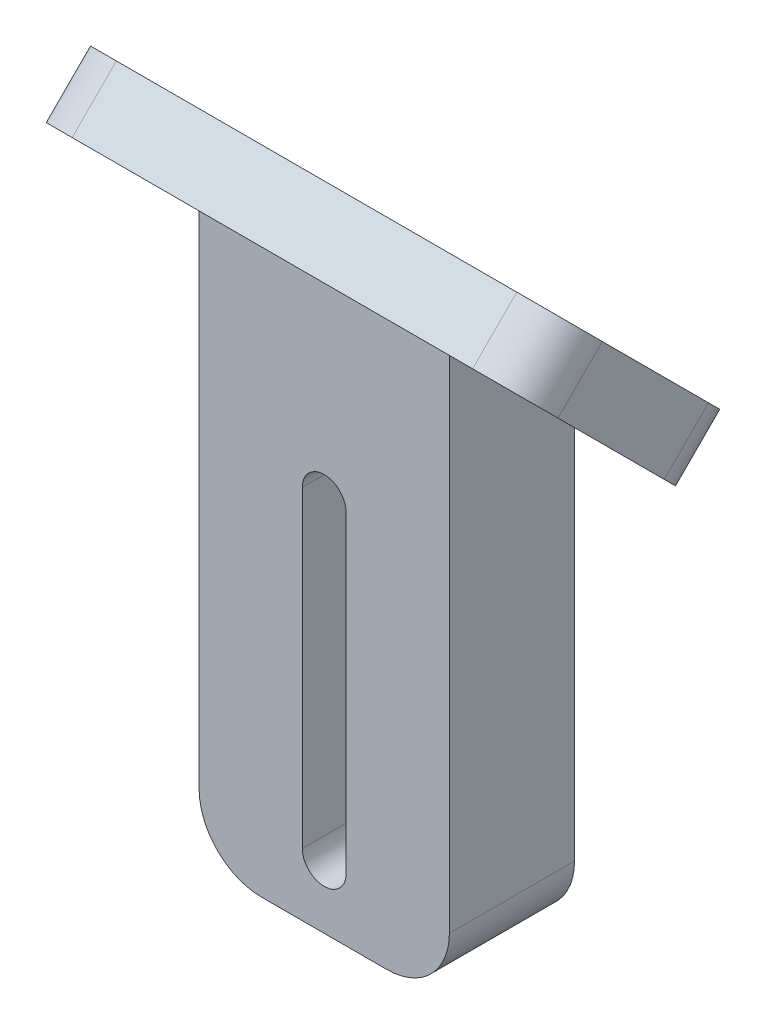
ISO-10303-21;
HEADER;
FILE_DESCRIPTION(('STEP AP214'),'2;1');
FILE_NAME('part.step','',(''),(''),'','','');
FILE_SCHEMA(('AUTOMOTIVE_DESIGN { 1 0 10303 214 1 1 1 1 }'));
ENDSEC;
DATA;
#1=APPLICATION_CONTEXT('core data for automotive mechanical design processes');
#2=APPLICATION_PROTOCOL_DEFINITION('international standard','automotive_design',2000,#1);
#3=PRODUCT_CONTEXT('',#1,'mechanical');
#4=PRODUCT('Part','Part','',(#3));
#5=PRODUCT_RELATED_PRODUCT_CATEGORY('part','',(#4));
#6=PRODUCT_DEFINITION_FORMATION('','',#4);
#7=PRODUCT_DEFINITION_CONTEXT('part definition',#1,'design');
#8=PRODUCT_DEFINITION('design','',#6,#7);
#9=PRODUCT_DEFINITION_SHAPE('','',#8);
#10=(LENGTH_UNIT() NAMED_UNIT(*) SI_UNIT(.MILLI.,.METRE.));
#11=(NAMED_UNIT(*) PLANE_ANGLE_UNIT() SI_UNIT($,.RADIAN.));
#12=(NAMED_UNIT(*) SI_UNIT($,.STERADIAN.) SOLID_ANGLE_UNIT());
#13=UNCERTAINTY_MEASURE_WITH_UNIT(LENGTH_MEASURE(1.E-05),#10,'distance_accuracy_value','');
#14=(GEOMETRIC_REPRESENTATION_CONTEXT(3) GLOBAL_UNCERTAINTY_ASSIGNED_CONTEXT((#13)) GLOBAL_UNIT_ASSIGNED_CONTEXT((#10,
#11,#12)) REPRESENTATION_CONTEXT('',''));
#15=CARTESIAN_POINT('',(0.,0.,0.));
#16=DIRECTION('',(0.,0.,1.));
#17=DIRECTION('',(1.,0.,0.));
#18=AXIS2_PLACEMENT_3D('',#15,#16,#17);
#19=CARTESIAN_POINT('',(10.,-35.0000000000001,10.));
#20=DIRECTION('',(0.,0.,-1.));
#21=DIRECTION('',(0.,1.,0.));
#22=AXIS2_PLACEMENT_3D('',#19,#20,#21);
#23=PLANE('',#22);
#24=DIRECTION('',(0.,-1.,0.));
#25=VECTOR('',#24,1.);
#26=CARTESIAN_POINT('',(-1.75,-5.,10.));
#27=LINE('',#26,#25);
#28=CARTESIAN_POINT('',(-1.75,-5.,10.));
#29=VERTEX_POINT('',#28);
#30=CARTESIAN_POINT('',(-1.75,-30.0000000000001,10.));
#31=VERTEX_POINT('',#30);
#32=EDGE_CURVE('E342',#29,#31,#27,.T.);
#33=ORIENTED_EDGE('',*,*,#32,.F.);
#34=CARTESIAN_POINT('',(0.,-5.,10.));
#35=DIRECTION('',(0.,0.,1.));
#36=DIRECTION('',(1.,0.,0.));
#37=AXIS2_PLACEMENT_3D('',#34,#35,#36);
#38=CIRCLE('',#37,1.75);
#39=CARTESIAN_POINT('',(1.75,-5.,10.));
#40=VERTEX_POINT('',#39);
#41=EDGE_CURVE('E339',#40,#29,#38,.T.);
#42=ORIENTED_EDGE('',*,*,#41,.F.);
#43=DIRECTION('',(0.,1.,0.));
#44=VECTOR('',#43,1.);
#45=CARTESIAN_POINT('',(1.75,-5.,10.));
#46=LINE('',#45,#44);
#47=CARTESIAN_POINT('',(1.75,-30.0000000000001,10.));
#48=VERTEX_POINT('',#47);
#49=EDGE_CURVE('E326',#48,#40,#46,.T.);
#50=ORIENTED_EDGE('',*,*,#49,.F.);
#51=CARTESIAN_POINT('',(0.,-30.0000000000001,10.));
#52=DIRECTION('',(0.,0.,1.));
#53=DIRECTION('',(1.,0.,0.));
#54=AXIS2_PLACEMENT_3D('',#51,#52,#53);
#55=CIRCLE('',#54,1.75);
#56=EDGE_CURVE('E347',#31,#48,#55,.T.);
#57=ORIENTED_EDGE('',*,*,#56,.F.);
#58=EDGE_LOOP('',(#33,#42,#50,#57));
#59=FACE_BOUND('',#58,.T.);
#60=DIRECTION('',(-1.,0.,0.));
#61=VECTOR('',#60,1.);
#62=CARTESIAN_POINT('',(10.,-35.0000000000001,10.));
#63=LINE('',#62,#61);
#64=CARTESIAN_POINT('',(5.,-35.0000000000001,10.));
#65=VERTEX_POINT('',#64);
#66=CARTESIAN_POINT('',(-5.,-35.0000000000001,10.));
#67=VERTEX_POINT('',#66);
#68=EDGE_CURVE('E178',#65,#67,#63,.T.);
#69=ORIENTED_EDGE('',*,*,#68,.F.);
#70=CARTESIAN_POINT('',(5.,-30.0000000000001,10.));
#71=DIRECTION('',(0.,0.,-1.));
#72=DIRECTION('',(0.,1.,0.));
#73=AXIS2_PLACEMENT_3D('',#70,#71,#72);
#74=CIRCLE('',#73,5.);
#75=CARTESIAN_POINT('',(10.,-30.0000000000001,10.));
#76=VERTEX_POINT('',#75);
#77=EDGE_CURVE('E238',#65,#76,#74,.F.);
#78=ORIENTED_EDGE('',*,*,#77,.T.);
#79=DIRECTION('',(0.,-1.,0.));
#80=VECTOR('',#79,1.);
#81=CARTESIAN_POINT('',(10.,-35.0000000000001,10.));
#82=LINE('',#81,#80);
#83=CARTESIAN_POINT('',(10.,9.9999999999999,10.));
#84=VERTEX_POINT('',#83);
#85=EDGE_CURVE('E171',#84,#76,#82,.T.);
#86=ORIENTED_EDGE('',*,*,#85,.F.);
#87=DIRECTION('',(-1.,0.,0.));
#88=VECTOR('',#87,1.);
#89=CARTESIAN_POINT('',(10.,9.9999999999999,10.));
#90=LINE('',#89,#88);
#91=CARTESIAN_POINT('',(-10.,9.9999999999999,9.99999999999999));
#92=VERTEX_POINT('',#91);
#93=EDGE_CURVE('E165',#84,#92,#90,.T.);
#94=ORIENTED_EDGE('',*,*,#93,.T.);
#95=DIRECTION('',(0.,-1.,0.));
#96=VECTOR('',#95,1.);
#97=CARTESIAN_POINT('',(-10.,-35.0000000000001,10.));
#98=LINE('',#97,#96);
#99=CARTESIAN_POINT('',(-10.,-30.0000000000001,10.));
#100=VERTEX_POINT('',#99);
#101=EDGE_CURVE('E168',#92,#100,#98,.T.);
#102=ORIENTED_EDGE('',*,*,#101,.T.);
#103=CARTESIAN_POINT('',(-5.,-30.0000000000001,10.));
#104=DIRECTION('',(0.,0.,-1.));
#105=DIRECTION('',(0.,1.,0.));
#106=AXIS2_PLACEMENT_3D('',#103,#104,#105);
#107=CIRCLE('',#106,5.);
#108=EDGE_CURVE('E235',#100,#67,#107,.F.);
#109=ORIENTED_EDGE('',*,*,#108,.T.);
#110=EDGE_LOOP('',(#69,#78,#86,#94,#102,#109));
#111=FACE_BOUND('',#110,.T.);
#112=ADVANCED_FACE('F39',(#59,#111),#23,.F.);
#113=CARTESIAN_POINT('',(10.,-35.0000000000001,0.));
#114=DIRECTION('',(0.,1.,0.));
#115=DIRECTION('',(0.,0.,1.));
#116=AXIS2_PLACEMENT_3D('',#113,#114,#115);
#117=PLANE('',#116);
#118=DIRECTION('',(-1.,0.,0.));
#119=VECTOR('',#118,1.);
#120=CARTESIAN_POINT('',(10.,-35.0000000000001,0.));
#121=LINE('',#120,#119);
#122=CARTESIAN_POINT('',(5.,-35.0000000000001,0.));
#123=VERTEX_POINT('',#122);
#124=CARTESIAN_POINT('',(-5.,-35.0000000000001,0.));
#125=VERTEX_POINT('',#124);
#126=EDGE_CURVE('E212',#123,#125,#121,.T.);
#127=ORIENTED_EDGE('',*,*,#126,.F.);
#128=DIRECTION('',(0.,0.,-1.));
#129=VECTOR('',#128,1.);
#130=CARTESIAN_POINT('',(5.,-35.0000000000001,0.));
#131=LINE('',#130,#129);
#132=EDGE_CURVE('E232',#123,#65,#131,.F.);
#133=ORIENTED_EDGE('',*,*,#132,.T.);
#134=ORIENTED_EDGE('',*,*,#68,.T.);
#135=DIRECTION('',(0.,0.,-1.));
#136=VECTOR('',#135,1.);
#137=CARTESIAN_POINT('',(-5.,-35.0000000000001,0.));
#138=LINE('',#137,#136);
#139=EDGE_CURVE('E228',#67,#125,#138,.T.);
#140=ORIENTED_EDGE('',*,*,#139,.T.);
#141=EDGE_LOOP('',(#127,#133,#134,#140));
#142=FACE_BOUND('',#141,.T.);
#143=ADVANCED_FACE('F428',(#142),#117,.F.);
#144=CARTESIAN_POINT('',(10.,0.,0.));
#145=DIRECTION('',(0.,0.,1.));
#146=DIRECTION('',(0.,-1.,0.));
#147=AXIS2_PLACEMENT_3D('',#144,#145,#146);
#148=PLANE('',#147);
#149=DIRECTION('',(0.,1.,0.));
#150=VECTOR('',#149,1.);
#151=CARTESIAN_POINT('',(1.75,-5.,0.));
#152=LINE('',#151,#150);
#153=CARTESIAN_POINT('',(1.75,-30.0000000000001,0.));
#154=VERTEX_POINT('',#153);
#155=CARTESIAN_POINT('',(1.75,-5.,0.));
#156=VERTEX_POINT('',#155);
#157=EDGE_CURVE('E334',#154,#156,#152,.T.);
#158=ORIENTED_EDGE('',*,*,#157,.T.);
#159=CARTESIAN_POINT('',(0.,-5.,0.));
#160=DIRECTION('',(0.,0.,1.));
#161=DIRECTION('',(1.,0.,0.));
#162=AXIS2_PLACEMENT_3D('',#159,#160,#161);
#163=CIRCLE('',#162,1.75);
#164=CARTESIAN_POINT('',(-1.75,-5.,0.));
#165=VERTEX_POINT('',#164);
#166=EDGE_CURVE('E321',#156,#165,#163,.T.);
#167=ORIENTED_EDGE('',*,*,#166,.T.);
#168=DIRECTION('',(0.,-1.,0.));
#169=VECTOR('',#168,1.);
#170=CARTESIAN_POINT('',(-1.75,-5.,0.));
#171=LINE('',#170,#169);
#172=CARTESIAN_POINT('',(-1.75,-30.0000000000001,0.));
#173=VERTEX_POINT('',#172);
#174=EDGE_CURVE('E325',#165,#173,#171,.T.);
#175=ORIENTED_EDGE('',*,*,#174,.T.);
#176=CARTESIAN_POINT('',(0.,-30.0000000000001,0.));
#177=DIRECTION('',(0.,0.,1.));
#178=DIRECTION('',(1.,0.,0.));
#179=AXIS2_PLACEMENT_3D('',#176,#177,#178);
#180=CIRCLE('',#179,1.75);
#181=EDGE_CURVE('E330',#173,#154,#180,.T.);
#182=ORIENTED_EDGE('',*,*,#181,.T.);
#183=EDGE_LOOP('',(#158,#167,#175,#182));
#184=FACE_BOUND('',#183,.T.);
#185=DIRECTION('',(0.,1.,0.));
#186=VECTOR('',#185,1.);
#187=CARTESIAN_POINT('',(10.,0.,0.));
#188=LINE('',#187,#186);
#189=CARTESIAN_POINT('',(10.,-30.0000000000001,0.));
#190=VERTEX_POINT('',#189);
#191=CARTESIAN_POINT('',(10.,0.,0.));
#192=VERTEX_POINT('',#191);
#193=EDGE_CURVE('E203',#190,#192,#188,.T.);
#194=ORIENTED_EDGE('',*,*,#193,.F.);
#195=CARTESIAN_POINT('',(5.,-30.0000000000001,0.));
#196=DIRECTION('',(0.,0.,1.));
#197=DIRECTION('',(0.,-1.,0.));
#198=AXIS2_PLACEMENT_3D('',#195,#196,#197);
#199=CIRCLE('',#198,5.);
#200=EDGE_CURVE('E225',#190,#123,#199,.F.);
#201=ORIENTED_EDGE('',*,*,#200,.T.);
#202=ORIENTED_EDGE('',*,*,#126,.T.);
#203=CARTESIAN_POINT('',(-5.,-30.0000000000001,0.));
#204=DIRECTION('',(0.,0.,1.));
#205=DIRECTION('',(0.,-1.,0.));
#206=AXIS2_PLACEMENT_3D('',#203,#204,#205);
#207=CIRCLE('',#206,5.);
#208=CARTESIAN_POINT('',(-10.,-30.0000000000001,0.));
#209=VERTEX_POINT('',#208);
#210=EDGE_CURVE('E222',#125,#209,#207,.F.);
#211=ORIENTED_EDGE('',*,*,#210,.T.);
#212=DIRECTION('',(0.,1.,0.));
#213=VECTOR('',#212,1.);
#214=CARTESIAN_POINT('',(-10.,0.,0.));
#215=LINE('',#214,#213);
#216=CARTESIAN_POINT('',(-10.,0.,0.));
#217=VERTEX_POINT('',#216);
#218=EDGE_CURVE('E189',#209,#217,#215,.T.);
#219=ORIENTED_EDGE('',*,*,#218,.T.);
#220=DIRECTION('',(-1.,0.,0.));
#221=VECTOR('',#220,1.);
#222=CARTESIAN_POINT('',(10.,0.,0.));
#223=LINE('',#222,#221);
#224=EDGE_CURVE('E209',#192,#217,#223,.T.);
#225=ORIENTED_EDGE('',*,*,#224,.F.);
#226=EDGE_LOOP('',(#194,#201,#202,#211,#219,#225));
#227=FACE_BOUND('',#226,.T.);
#228=ADVANCED_FACE('F372',(#184,#227),#148,.F.);
#229=CARTESIAN_POINT('',(10.,0.,0.));
#230=DIRECTION('',(-1.,0.,0.));
#231=DIRECTION('',(0.,0.,1.));
#232=AXIS2_PLACEMENT_3D('',#229,#230,#231);
#233=PLANE('',#232);
#234=ORIENTED_EDGE('',*,*,#85,.T.);
#235=DIRECTION('',(0.,0.,-1.));
#236=VECTOR('',#235,1.);
#237=CARTESIAN_POINT('',(10.,-30.0000000000001,0.));
#238=LINE('',#237,#236);
#239=EDGE_CURVE('E177',#76,#190,#238,.T.);
#240=ORIENTED_EDGE('',*,*,#239,.T.);
#241=ORIENTED_EDGE('',*,*,#193,.T.);
#242=DIRECTION('',(0.,0.707106781186544,0.707106781186551));
#243=VECTOR('',#242,1.);
#244=CARTESIAN_POINT('',(10.,9.9999999999999,10.));
#245=LINE('',#244,#243);
#246=EDGE_CURVE('E208',#192,#84,#245,.T.);
#247=ORIENTED_EDGE('',*,*,#246,.T.);
#248=EDGE_LOOP('',(#234,#240,#241,#247));
#249=FACE_BOUND('',#248,.T.);
#250=ADVANCED_FACE('F370',(#249),#233,.F.);
#251=CARTESIAN_POINT('',(-10.,0.,0.));
#252=DIRECTION('',(-1.,0.,0.));
#253=DIRECTION('',(0.,0.,1.));
#254=AXIS2_PLACEMENT_3D('',#251,#252,#253);
#255=PLANE('',#254);
#256=ORIENTED_EDGE('',*,*,#218,.F.);
#257=DIRECTION('',(0.,0.,-1.));
#258=VECTOR('',#257,1.);
#259=CARTESIAN_POINT('',(-10.,-30.0000000000001,10.));
#260=LINE('',#259,#258);
#261=EDGE_CURVE('E187',#209,#100,#260,.F.);
#262=ORIENTED_EDGE('',*,*,#261,.T.);
#263=ORIENTED_EDGE('',*,*,#101,.F.);
#264=DIRECTION('',(0.,0.707106781186544,0.707106781186551));
#265=VECTOR('',#264,1.);
#266=CARTESIAN_POINT('',(-10.,9.9999999999999,10.));
#267=LINE('',#266,#265);
#268=EDGE_CURVE('E184',#217,#92,#267,.T.);
#269=ORIENTED_EDGE('',*,*,#268,.F.);
#270=EDGE_LOOP('',(#256,#262,#263,#269));
#271=FACE_BOUND('',#270,.T.);
#272=ADVANCED_FACE('F183',(#271),#255,.T.);
#273=CARTESIAN_POINT('',(0.,-5.,0.));
#274=DIRECTION('',(0.,0.,1.));
#275=DIRECTION('',(1.,0.,0.));
#276=AXIS2_PLACEMENT_3D('',#273,#274,#275);
#277=CYLINDRICAL_SURFACE('',#276,1.75);
#278=ORIENTED_EDGE('',*,*,#41,.T.);
#279=DIRECTION('',(0.,0.,1.));
#280=VECTOR('',#279,1.);
#281=CARTESIAN_POINT('',(-1.75,-5.,0.));
#282=LINE('',#281,#280);
#283=EDGE_CURVE('E338',#165,#29,#282,.T.);
#284=ORIENTED_EDGE('',*,*,#283,.F.);
#285=ORIENTED_EDGE('',*,*,#166,.F.);
#286=DIRECTION('',(0.,0.,1.));
#287=VECTOR('',#286,1.);
#288=CARTESIAN_POINT('',(1.75,-5.,0.));
#289=LINE('',#288,#287);
#290=EDGE_CURVE('E197',#156,#40,#289,.T.);
#291=ORIENTED_EDGE('',*,*,#290,.T.);
#292=EDGE_LOOP('',(#278,#284,#285,#291));
#293=FACE_BOUND('',#292,.T.);
#294=ADVANCED_FACE('F479',(#293),#277,.F.);
#295=CARTESIAN_POINT('',(1.75,-5.,0.));
#296=DIRECTION('',(1.,0.,0.));
#297=DIRECTION('',(0.,1.,0.));
#298=AXIS2_PLACEMENT_3D('',#295,#296,#297);
#299=PLANE('',#298);
#300=ORIENTED_EDGE('',*,*,#49,.T.);
#301=ORIENTED_EDGE('',*,*,#290,.F.);
#302=ORIENTED_EDGE('',*,*,#157,.F.);
#303=DIRECTION('',(0.,0.,1.));
#304=VECTOR('',#303,1.);
#305=CARTESIAN_POINT('',(1.75,-30.0000000000001,0.));
#306=LINE('',#305,#304);
#307=EDGE_CURVE('E200',#154,#48,#306,.T.);
#308=ORIENTED_EDGE('',*,*,#307,.T.);
#309=EDGE_LOOP('',(#300,#301,#302,#308));
#310=FACE_BOUND('',#309,.T.);
#311=ADVANCED_FACE('F475',(#310),#299,.F.);
#312=CARTESIAN_POINT('',(0.,-30.0000000000001,0.));
#313=DIRECTION('',(0.,0.,1.));
#314=DIRECTION('',(1.,0.,0.));
#315=AXIS2_PLACEMENT_3D('',#312,#313,#314);
#316=CYLINDRICAL_SURFACE('',#315,1.75);
#317=ORIENTED_EDGE('',*,*,#56,.T.);
#318=ORIENTED_EDGE('',*,*,#307,.F.);
#319=ORIENTED_EDGE('',*,*,#181,.F.);
#320=DIRECTION('',(0.,0.,1.));
#321=VECTOR('',#320,1.);
#322=CARTESIAN_POINT('',(-1.75,-30.0000000000001,0.));
#323=LINE('',#322,#321);
#324=EDGE_CURVE('E356',#173,#31,#323,.T.);
#325=ORIENTED_EDGE('',*,*,#324,.T.);
#326=EDGE_LOOP('',(#317,#318,#319,#325));
#327=FACE_BOUND('',#326,.T.);
#328=ADVANCED_FACE('F478',(#327),#316,.F.);
#329=CARTESIAN_POINT('',(-1.75,-5.,0.));
#330=DIRECTION('',(-1.,0.,0.));
#331=DIRECTION('',(0.,-1.,0.));
#332=AXIS2_PLACEMENT_3D('',#329,#330,#331);
#333=PLANE('',#332);
#334=ORIENTED_EDGE('',*,*,#32,.T.);
#335=ORIENTED_EDGE('',*,*,#324,.F.);
#336=ORIENTED_EDGE('',*,*,#174,.F.);
#337=ORIENTED_EDGE('',*,*,#283,.T.);
#338=EDGE_LOOP('',(#334,#335,#336,#337));
#339=FACE_BOUND('',#338,.T.);
#340=ADVANCED_FACE('F442',(#339),#333,.F.);
#341=CARTESIAN_POINT('',(5.,-30.0000000000001,0.));
#342=DIRECTION('',(0.,0.,-1.));
#343=DIRECTION('',(-1.,0.,0.));
#344=AXIS2_PLACEMENT_3D('',#341,#342,#343);
#345=CYLINDRICAL_SURFACE('',#344,5.);
#346=ORIENTED_EDGE('',*,*,#77,.F.);
#347=ORIENTED_EDGE('',*,*,#132,.F.);
#348=ORIENTED_EDGE('',*,*,#200,.F.);
#349=ORIENTED_EDGE('',*,*,#239,.F.);
#350=EDGE_LOOP('',(#346,#347,#348,#349));
#351=FACE_BOUND('',#350,.T.);
#352=ADVANCED_FACE('F439',(#351),#345,.T.);
#353=CARTESIAN_POINT('',(-5.,-30.0000000000001,0.));
#354=DIRECTION('',(0.,0.,1.));
#355=DIRECTION('',(1.,0.,0.));
#356=AXIS2_PLACEMENT_3D('',#353,#354,#355);
#357=CYLINDRICAL_SURFACE('',#356,5.);
#358=ORIENTED_EDGE('',*,*,#108,.F.);
#359=ORIENTED_EDGE('',*,*,#261,.F.);
#360=ORIENTED_EDGE('',*,*,#210,.F.);
#361=ORIENTED_EDGE('',*,*,#139,.F.);
#362=EDGE_LOOP('',(#358,#359,#360,#361));
#363=FACE_BOUND('',#362,.T.);
#364=ADVANCED_FACE('F411',(#363),#357,.T.);
#365=CARTESIAN_POINT('',(0.,0.,0.));
#366=DIRECTION('',(0.,0.707106781186551,-0.707106781186544));
#367=DIRECTION('',(0.,0.707106781186544,0.707106781186551));
#368=AXIS2_PLACEMENT_3D('',#365,#366,#367);
#369=PLANE('',#368);
#370=CARTESIAN_POINT('',(-15.,7.07106781186544,7.07106781186551));
#371=DIRECTION('',(0.,-0.707106781186551,0.707106781186544));
#372=DIRECTION('',(0.,-0.707106781186544,-0.707106781186551));
#373=AXIS2_PLACEMENT_3D('',#370,#371,#372);
#374=CIRCLE('',#373,1.75);
#375=CARTESIAN_POINT('',(-15.,5.83363094478899,5.83363094478905));
#376=VERTEX_POINT('',#375);
#377=EDGE_CURVE('E249',#376,#376,#374,.T.);
#378=ORIENTED_EDGE('',*,*,#377,.F.);
#379=EDGE_LOOP('',(#378));
#380=FACE_BOUND('',#379,.T.);
#381=CARTESIAN_POINT('',(15.,7.07106781186544,7.07106781186551));
#382=DIRECTION('',(0.,-0.707106781186551,0.707106781186544));
#383=DIRECTION('',(0.,-0.707106781186544,-0.707106781186551));
#384=AXIS2_PLACEMENT_3D('',#381,#382,#383);
#385=CIRCLE('',#384,1.75);
#386=CARTESIAN_POINT('',(15.,5.83363094478899,5.83363094478905));
#387=VERTEX_POINT('',#386);
#388=EDGE_CURVE('E398',#387,#387,#385,.T.);
#389=ORIENTED_EDGE('',*,*,#388,.F.);
#390=EDGE_LOOP('',(#389));
#391=FACE_BOUND('',#390,.T.);
#392=DIRECTION('',(-1.,0.,0.));
#393=VECTOR('',#392,1.);
#394=CARTESIAN_POINT('',(-20.,0.,0.));
#395=LINE('',#394,#393);
#396=CARTESIAN_POINT('',(16.,0.,0.));
#397=VERTEX_POINT('',#396);
#398=EDGE_CURVE('E317',#397,#192,#395,.T.);
#399=ORIENTED_EDGE('',*,*,#398,.F.);
#400=CARTESIAN_POINT('',(16.,2.82842712474618,2.8284271247462));
#401=DIRECTION('',(0.,0.707106781186551,-0.707106781186544));
#402=DIRECTION('',(0.,0.707106781186544,0.707106781186551));
#403=AXIS2_PLACEMENT_3D('',#400,#401,#402);
#404=CIRCLE('',#403,4.);
#405=CARTESIAN_POINT('',(20.,2.82842712474618,2.8284271247462));
#406=VERTEX_POINT('',#405);
#407=EDGE_CURVE('E269',#397,#406,#404,.F.);
#408=ORIENTED_EDGE('',*,*,#407,.T.);
#409=DIRECTION('',(0.,-0.707106781186544,-0.707106781186551));
#410=VECTOR('',#409,1.);
#411=CARTESIAN_POINT('',(20.,0.,0.));
#412=LINE('',#411,#410);
#413=CARTESIAN_POINT('',(20.,11.3137084989847,11.3137084989848));
#414=VERTEX_POINT('',#413);
#415=EDGE_CURVE('E308',#414,#406,#412,.T.);
#416=ORIENTED_EDGE('',*,*,#415,.F.);
#417=CARTESIAN_POINT('',(16.,11.3137084989847,11.3137084989848));
#418=DIRECTION('',(0.,0.707106781186551,-0.707106781186544));
#419=DIRECTION('',(0.,0.707106781186544,0.707106781186551));
#420=AXIS2_PLACEMENT_3D('',#417,#418,#419);
#421=CIRCLE('',#420,4.);
#422=CARTESIAN_POINT('',(16.,14.1421356237309,14.142135623731));
#423=VERTEX_POINT('',#422);
#424=EDGE_CURVE('E263',#414,#423,#421,.F.);
#425=ORIENTED_EDGE('',*,*,#424,.T.);
#426=DIRECTION('',(1.,0.,0.));
#427=VECTOR('',#426,1.);
#428=CARTESIAN_POINT('',(-20.,14.1421356237309,14.142135623731));
#429=LINE('',#428,#427);
#430=CARTESIAN_POINT('',(-16.,14.1421356237309,14.142135623731));
#431=VERTEX_POINT('',#430);
#432=EDGE_CURVE('E301',#431,#423,#429,.T.);
#433=ORIENTED_EDGE('',*,*,#432,.F.);
#434=CARTESIAN_POINT('',(-16.,11.3137084989847,11.3137084989848));
#435=DIRECTION('',(0.,0.707106781186551,-0.707106781186544));
#436=DIRECTION('',(0.,0.707106781186544,0.707106781186551));
#437=AXIS2_PLACEMENT_3D('',#434,#435,#436);
#438=CIRCLE('',#437,4.);
#439=CARTESIAN_POINT('',(-20.,11.3137084989847,11.3137084989848));
#440=VERTEX_POINT('',#439);
#441=EDGE_CURVE('E260',#431,#440,#438,.F.);
#442=ORIENTED_EDGE('',*,*,#441,.T.);
#443=DIRECTION('',(0.,0.707106781186544,0.707106781186551));
#444=VECTOR('',#443,1.);
#445=CARTESIAN_POINT('',(-20.,0.,0.));
#446=LINE('',#445,#444);
#447=CARTESIAN_POINT('',(-20.,2.82842712474618,2.8284271247462));
#448=VERTEX_POINT('',#447);
#449=EDGE_CURVE('E253',#448,#440,#446,.T.);
#450=ORIENTED_EDGE('',*,*,#449,.F.);
#451=CARTESIAN_POINT('',(-16.,2.82842712474618,2.8284271247462));
#452=DIRECTION('',(0.,0.707106781186551,-0.707106781186544));
#453=DIRECTION('',(0.,0.707106781186544,0.707106781186551));
#454=AXIS2_PLACEMENT_3D('',#451,#452,#453);
#455=CIRCLE('',#454,4.);
#456=CARTESIAN_POINT('',(-16.,0.,0.));
#457=VERTEX_POINT('',#456);
#458=EDGE_CURVE('E266',#448,#457,#455,.F.);
#459=ORIENTED_EDGE('',*,*,#458,.T.);
#460=EDGE_CURVE('E194',#217,#457,#395,.T.);
#461=ORIENTED_EDGE('',*,*,#460,.F.);
#462=ORIENTED_EDGE('',*,*,#268,.T.);
#463=ORIENTED_EDGE('',*,*,#93,.F.);
#464=ORIENTED_EDGE('',*,*,#246,.F.);
#465=EDGE_LOOP('',(#399,#408,#416,#425,#433,#442,#450,#459,#461,#462,#463,#464));
#466=FACE_BOUND('',#465,.T.);
#467=ADVANCED_FACE('F192',(#380,#391,#466),#369,.F.);
#468=CARTESIAN_POINT('',(-20.,3.53553390593276,-3.53553390593272));
#469=DIRECTION('',(1.,0.,0.));
#470=DIRECTION('',(0.,0.,-1.));
#471=AXIS2_PLACEMENT_3D('',#468,#469,#470);
#472=PLANE('',#471);
#473=DIRECTION('',(0.,0.707106781186544,0.707106781186551));
#474=VECTOR('',#473,1.);
#475=CARTESIAN_POINT('',(-20.,3.53553390593276,-3.53553390593272));
#476=LINE('',#475,#474);
#477=CARTESIAN_POINT('',(-20.,6.36396103067893,-0.707106781186516));
#478=VERTEX_POINT('',#477);
#479=CARTESIAN_POINT('',(-20.,14.8492424049175,7.7781745930521));
#480=VERTEX_POINT('',#479);
#481=EDGE_CURVE('E320',#478,#480,#476,.T.);
#482=ORIENTED_EDGE('',*,*,#481,.F.);
#483=DIRECTION('',(0.,-0.707106781186551,0.707106781186544));
#484=VECTOR('',#483,1.);
#485=CARTESIAN_POINT('',(-20.,6.36396103067893,-0.707106781186516));
#486=LINE('',#485,#484);
#487=EDGE_CURVE('E293',#478,#448,#486,.T.);
#488=ORIENTED_EDGE('',*,*,#487,.T.);
#489=ORIENTED_EDGE('',*,*,#449,.T.);
#490=DIRECTION('',(0.,-0.707106781186551,0.707106781186544));
#491=VECTOR('',#490,1.);
#492=CARTESIAN_POINT('',(-20.,14.8492424049175,7.7781745930521));
#493=LINE('',#492,#491);
#494=EDGE_CURVE('E290',#440,#480,#493,.F.);
#495=ORIENTED_EDGE('',*,*,#494,.T.);
#496=EDGE_LOOP('',(#482,#488,#489,#495));
#497=FACE_BOUND('',#496,.T.);
#498=ADVANCED_FACE('F410',(#497),#472,.F.);
#499=CARTESIAN_POINT('',(-20.,17.6776695296636,10.6066017177983));
#500=DIRECTION('',(0.,-0.707106781186544,-0.707106781186551));
#501=DIRECTION('',(0.,0.707106781186551,-0.707106781186544));
#502=AXIS2_PLACEMENT_3D('',#499,#500,#501);
#503=PLANE('',#502);
#504=ORIENTED_EDGE('',*,*,#432,.T.);
#505=DIRECTION('',(0.,-0.707106781186551,0.707106781186544));
#506=VECTOR('',#505,1.);
#507=CARTESIAN_POINT('',(16.,17.6776695296636,10.6066017177983));
#508=LINE('',#507,#506);
#509=CARTESIAN_POINT('',(16.,17.6776695296636,10.6066017177983));
#510=VERTEX_POINT('',#509);
#511=EDGE_CURVE('E11',#423,#510,#508,.F.);
#512=ORIENTED_EDGE('',*,*,#511,.T.);
#513=DIRECTION('',(1.,0.,0.));
#514=VECTOR('',#513,1.);
#515=CARTESIAN_POINT('',(-20.,17.6776695296636,10.6066017177983));
#516=LINE('',#515,#514);
#517=CARTESIAN_POINT('',(-16.,17.6776695296636,10.6066017177983));
#518=VERTEX_POINT('',#517);
#519=EDGE_CURVE('E302',#518,#510,#516,.T.);
#520=ORIENTED_EDGE('',*,*,#519,.F.);
#521=DIRECTION('',(0.,-0.707106781186551,0.707106781186544));
#522=VECTOR('',#521,1.);
#523=CARTESIAN_POINT('',(-16.,17.6776695296636,10.6066017177983));
#524=LINE('',#523,#522);
#525=EDGE_CURVE('E48',#518,#431,#524,.T.);
#526=ORIENTED_EDGE('',*,*,#525,.T.);
#527=EDGE_LOOP('',(#504,#512,#520,#526));
#528=FACE_BOUND('',#527,.T.);
#529=ADVANCED_FACE('F300',(#528),#503,.F.);
#530=CARTESIAN_POINT('',(20.,3.53553390593276,-3.53553390593272));
#531=DIRECTION('',(-1.,0.,0.));
#532=DIRECTION('',(0.,0.,1.));
#533=AXIS2_PLACEMENT_3D('',#530,#531,#532);
#534=PLANE('',#533);
#535=ORIENTED_EDGE('',*,*,#415,.T.);
#536=DIRECTION('',(0.,-0.707106781186551,0.707106781186544));
#537=VECTOR('',#536,1.);
#538=CARTESIAN_POINT('',(20.,6.36396103067893,-0.707106781186517));
#539=LINE('',#538,#537);
#540=CARTESIAN_POINT('',(20.,6.36396103067893,-0.707106781186516));
#541=VERTEX_POINT('',#540);
#542=EDGE_CURVE('E276',#406,#541,#539,.F.);
#543=ORIENTED_EDGE('',*,*,#542,.T.);
#544=DIRECTION('',(0.,-0.707106781186544,-0.707106781186551));
#545=VECTOR('',#544,1.);
#546=CARTESIAN_POINT('',(20.,3.53553390593276,-3.53553390593272));
#547=LINE('',#546,#545);
#548=CARTESIAN_POINT('',(20.,14.8492424049175,7.7781745930521));
#549=VERTEX_POINT('',#548);
#550=EDGE_CURVE('E386',#549,#541,#547,.T.);
#551=ORIENTED_EDGE('',*,*,#550,.F.);
#552=DIRECTION('',(0.,-0.707106781186551,0.707106781186544));
#553=VECTOR('',#552,1.);
#554=CARTESIAN_POINT('',(20.,14.8492424049175,7.7781745930521));
#555=LINE('',#554,#553);
#556=EDGE_CURVE('E272',#549,#414,#555,.T.);
#557=ORIENTED_EDGE('',*,*,#556,.T.);
#558=EDGE_LOOP('',(#535,#543,#551,#557));
#559=FACE_BOUND('',#558,.T.);
#560=ADVANCED_FACE('F385',(#559),#534,.F.);
#561=CARTESIAN_POINT('',(-20.,3.53553390593276,-3.53553390593272));
#562=DIRECTION('',(0.,0.707106781186544,0.707106781186551));
#563=DIRECTION('',(0.,-0.707106781186551,0.707106781186544));
#564=AXIS2_PLACEMENT_3D('',#561,#562,#563);
#565=PLANE('',#564);
#566=DIRECTION('',(-1.,0.,0.));
#567=VECTOR('',#566,1.);
#568=CARTESIAN_POINT('',(-20.,3.53553390593276,-3.53553390593272));
#569=LINE('',#568,#567);
#570=CARTESIAN_POINT('',(16.,3.53553390593276,-3.53553390593272));
#571=VERTEX_POINT('',#570);
#572=CARTESIAN_POINT('',(-16.,3.53553390593276,-3.53553390593272));
#573=VERTEX_POINT('',#572);
#574=EDGE_CURVE('E343',#571,#573,#569,.T.);
#575=ORIENTED_EDGE('',*,*,#574,.F.);
#576=DIRECTION('',(0.,-0.707106781186551,0.707106781186544));
#577=VECTOR('',#576,1.);
#578=CARTESIAN_POINT('',(16.,3.53553390593276,-3.53553390593272));
#579=LINE('',#578,#577);
#580=EDGE_CURVE('E256',#571,#397,#579,.T.);
#581=ORIENTED_EDGE('',*,*,#580,.T.);
#582=ORIENTED_EDGE('',*,*,#398,.T.);
#583=ORIENTED_EDGE('',*,*,#224,.T.);
#584=ORIENTED_EDGE('',*,*,#460,.T.);
#585=DIRECTION('',(0.,-0.707106781186551,0.707106781186544));
#586=VECTOR('',#585,1.);
#587=CARTESIAN_POINT('',(-16.,3.53553390593276,-3.53553390593272));
#588=LINE('',#587,#586);
#589=EDGE_CURVE('E243',#457,#573,#588,.F.);
#590=ORIENTED_EDGE('',*,*,#589,.T.);
#591=EDGE_LOOP('',(#575,#581,#582,#583,#584,#590));
#592=FACE_BOUND('',#591,.T.);
#593=ADVANCED_FACE('F375',(#592),#565,.F.);
#594=CARTESIAN_POINT('',(0.,3.53553390593276,-3.53553390593272));
#595=DIRECTION('',(0.,0.707106781186551,-0.707106781186544));
#596=DIRECTION('',(0.,0.707106781186544,0.707106781186551));
#597=AXIS2_PLACEMENT_3D('',#594,#595,#596);
#598=PLANE('',#597);
#599=CARTESIAN_POINT('',(-15.,10.6066017177982,3.53553390593279));
#600=DIRECTION('',(0.,0.707106781186551,-0.707106781186544));
#601=DIRECTION('',(0.,0.707106781186544,0.707106781186551));
#602=AXIS2_PLACEMENT_3D('',#599,#600,#601);
#603=CIRCLE('',#602,1.75);
#604=CARTESIAN_POINT('',(-15.,11.8440385848746,4.77297077300926));
#605=VERTEX_POINT('',#604);
#606=EDGE_CURVE('E248',#605,#605,#603,.T.);
#607=ORIENTED_EDGE('',*,*,#606,.F.);
#608=EDGE_LOOP('',(#607));
#609=FACE_BOUND('',#608,.T.);
#610=CARTESIAN_POINT('',(15.,10.6066017177982,3.53553390593279));
#611=DIRECTION('',(0.,0.707106781186551,-0.707106781186544));
#612=DIRECTION('',(0.,0.707106781186544,0.707106781186551));
#613=AXIS2_PLACEMENT_3D('',#610,#611,#612);
#614=CIRCLE('',#613,1.75);
#615=CARTESIAN_POINT('',(15.,11.8440385848746,4.77297077300925));
#616=VERTEX_POINT('',#615);
#617=EDGE_CURVE('E244',#616,#616,#614,.T.);
#618=ORIENTED_EDGE('',*,*,#617,.F.);
#619=EDGE_LOOP('',(#618));
#620=FACE_BOUND('',#619,.T.);
#621=ORIENTED_EDGE('',*,*,#550,.T.);
#622=CARTESIAN_POINT('',(16.,6.36396103067893,-0.707106781186516));
#623=DIRECTION('',(0.,0.707106781186551,-0.707106781186544));
#624=DIRECTION('',(0.,0.707106781186544,0.707106781186551));
#625=AXIS2_PLACEMENT_3D('',#622,#623,#624);
#626=CIRCLE('',#625,4.);
#627=EDGE_CURVE('E287',#541,#571,#626,.T.);
#628=ORIENTED_EDGE('',*,*,#627,.T.);
#629=ORIENTED_EDGE('',*,*,#574,.T.);
#630=CARTESIAN_POINT('',(-16.,6.36396103067893,-0.707106781186517));
#631=DIRECTION('',(0.,0.707106781186551,-0.707106781186544));
#632=DIRECTION('',(0.,0.707106781186544,0.707106781186551));
#633=AXIS2_PLACEMENT_3D('',#630,#631,#632);
#634=CIRCLE('',#633,4.);
#635=EDGE_CURVE('E284',#573,#478,#634,.T.);
#636=ORIENTED_EDGE('',*,*,#635,.T.);
#637=ORIENTED_EDGE('',*,*,#481,.T.);
#638=CARTESIAN_POINT('',(-16.,14.8492424049175,7.7781745930521));
#639=DIRECTION('',(0.,0.707106781186551,-0.707106781186544));
#640=DIRECTION('',(0.,0.707106781186544,0.707106781186551));
#641=AXIS2_PLACEMENT_3D('',#638,#639,#640);
#642=CIRCLE('',#641,4.);
#643=EDGE_CURVE('E60',#480,#518,#642,.T.);
#644=ORIENTED_EDGE('',*,*,#643,.T.);
#645=ORIENTED_EDGE('',*,*,#519,.T.);
#646=CARTESIAN_POINT('',(16.,14.8492424049175,7.7781745930521));
#647=DIRECTION('',(0.,0.707106781186551,-0.707106781186544));
#648=DIRECTION('',(0.,0.707106781186544,0.707106781186551));
#649=AXIS2_PLACEMENT_3D('',#646,#647,#648);
#650=CIRCLE('',#649,4.);
#651=EDGE_CURVE('E281',#510,#549,#650,.T.);
#652=ORIENTED_EDGE('',*,*,#651,.T.);
#653=EDGE_LOOP('',(#621,#628,#629,#636,#637,#644,#645,#652));
#654=FACE_BOUND('',#653,.T.);
#655=ADVANCED_FACE('F388',(#609,#620,#654),#598,.T.);
#656=CARTESIAN_POINT('',(15.,17.6776695296637,-3.53553390593265));
#657=DIRECTION('',(0.,-0.707106781186551,0.707106781186544));
#658=DIRECTION('',(0.,-0.707106781186544,-0.707106781186551));
#659=AXIS2_PLACEMENT_3D('',#656,#657,#658);
#660=CYLINDRICAL_SURFACE('',#659,1.75);
#661=ORIENTED_EDGE('',*,*,#617,.T.);
#662=EDGE_LOOP('',(#661));
#663=FACE_BOUND('',#662,.T.);
#664=ORIENTED_EDGE('',*,*,#388,.T.);
#665=EDGE_LOOP('',(#664));
#666=FACE_BOUND('',#665,.T.);
#667=ADVANCED_FACE('F415',(#663,#666),#660,.F.);
#668=CARTESIAN_POINT('',(-15.,17.6776695296637,-3.53553390593265));
#669=DIRECTION('',(0.,-0.707106781186551,0.707106781186544));
#670=DIRECTION('',(0.,-0.707106781186544,-0.707106781186551));
#671=AXIS2_PLACEMENT_3D('',#668,#669,#670);
#672=CYLINDRICAL_SURFACE('',#671,1.75);
#673=ORIENTED_EDGE('',*,*,#606,.T.);
#674=EDGE_LOOP('',(#673));
#675=FACE_BOUND('',#674,.T.);
#676=ORIENTED_EDGE('',*,*,#377,.T.);
#677=EDGE_LOOP('',(#676));
#678=FACE_BOUND('',#677,.T.);
#679=ADVANCED_FACE('F406',(#675,#678),#672,.F.);
#680=CARTESIAN_POINT('',(16.,6.36396103067893,-0.707106781186516));
#681=DIRECTION('',(0.,-0.707106781186551,0.707106781186544));
#682=DIRECTION('',(0.,-0.707106781186544,-0.707106781186551));
#683=AXIS2_PLACEMENT_3D('',#680,#681,#682);
#684=CYLINDRICAL_SURFACE('',#683,4.);
#685=ORIENTED_EDGE('',*,*,#627,.F.);
#686=ORIENTED_EDGE('',*,*,#542,.F.);
#687=ORIENTED_EDGE('',*,*,#407,.F.);
#688=ORIENTED_EDGE('',*,*,#580,.F.);
#689=EDGE_LOOP('',(#685,#686,#687,#688));
#690=FACE_BOUND('',#689,.T.);
#691=ADVANCED_FACE('F380',(#690),#684,.T.);
#692=CARTESIAN_POINT('',(-16.,6.36396103067893,-0.707106781186516));
#693=DIRECTION('',(0.,-0.707106781186551,0.707106781186544));
#694=DIRECTION('',(0.,-0.707106781186544,-0.707106781186551));
#695=AXIS2_PLACEMENT_3D('',#692,#693,#694);
#696=CYLINDRICAL_SURFACE('',#695,4.);
#697=ORIENTED_EDGE('',*,*,#635,.F.);
#698=ORIENTED_EDGE('',*,*,#589,.F.);
#699=ORIENTED_EDGE('',*,*,#458,.F.);
#700=ORIENTED_EDGE('',*,*,#487,.F.);
#701=EDGE_LOOP('',(#697,#698,#699,#700));
#702=FACE_BOUND('',#701,.T.);
#703=ADVANCED_FACE('F449',(#702),#696,.T.);
#704=CARTESIAN_POINT('',(16.,14.8492424049175,7.7781745930521));
#705=DIRECTION('',(0.,-0.707106781186551,0.707106781186544));
#706=DIRECTION('',(0.,-0.707106781186544,-0.707106781186551));
#707=AXIS2_PLACEMENT_3D('',#704,#705,#706);
#708=CYLINDRICAL_SURFACE('',#707,4.);
#709=ORIENTED_EDGE('',*,*,#651,.F.);
#710=ORIENTED_EDGE('',*,*,#511,.F.);
#711=ORIENTED_EDGE('',*,*,#424,.F.);
#712=ORIENTED_EDGE('',*,*,#556,.F.);
#713=EDGE_LOOP('',(#709,#710,#711,#712));
#714=FACE_BOUND('',#713,.T.);
#715=ADVANCED_FACE('F451',(#714),#708,.T.);
#716=CARTESIAN_POINT('',(-16.,14.8492424049175,7.7781745930521));
#717=DIRECTION('',(0.,-0.707106781186551,0.707106781186544));
#718=DIRECTION('',(0.,-0.707106781186544,-0.707106781186551));
#719=AXIS2_PLACEMENT_3D('',#716,#717,#718);
#720=CYLINDRICAL_SURFACE('',#719,4.);
#721=ORIENTED_EDGE('',*,*,#643,.F.);
#722=ORIENTED_EDGE('',*,*,#494,.F.);
#723=ORIENTED_EDGE('',*,*,#441,.F.);
#724=ORIENTED_EDGE('',*,*,#525,.F.);
#725=EDGE_LOOP('',(#721,#722,#723,#724));
#726=FACE_BOUND('',#725,.T.);
#727=ADVANCED_FACE('F41',(#726),#720,.T.);
#728=CLOSED_SHELL('',(#112,#143,#228,#250,#272,#294,#311,#328,#340,#352,#364,#467,#498,#529,
#560,#593,#655,#667,#679,#691,#703,#715,#727));
#729=MANIFOLD_SOLID_BREP('B2',#728);
#730=ADVANCED_BREP_SHAPE_REPRESENTATION('',(#18,#729),#14);
#731=SHAPE_DEFINITION_REPRESENTATION(#9,#730);
ENDSEC;
END-ISO-10303-21;
